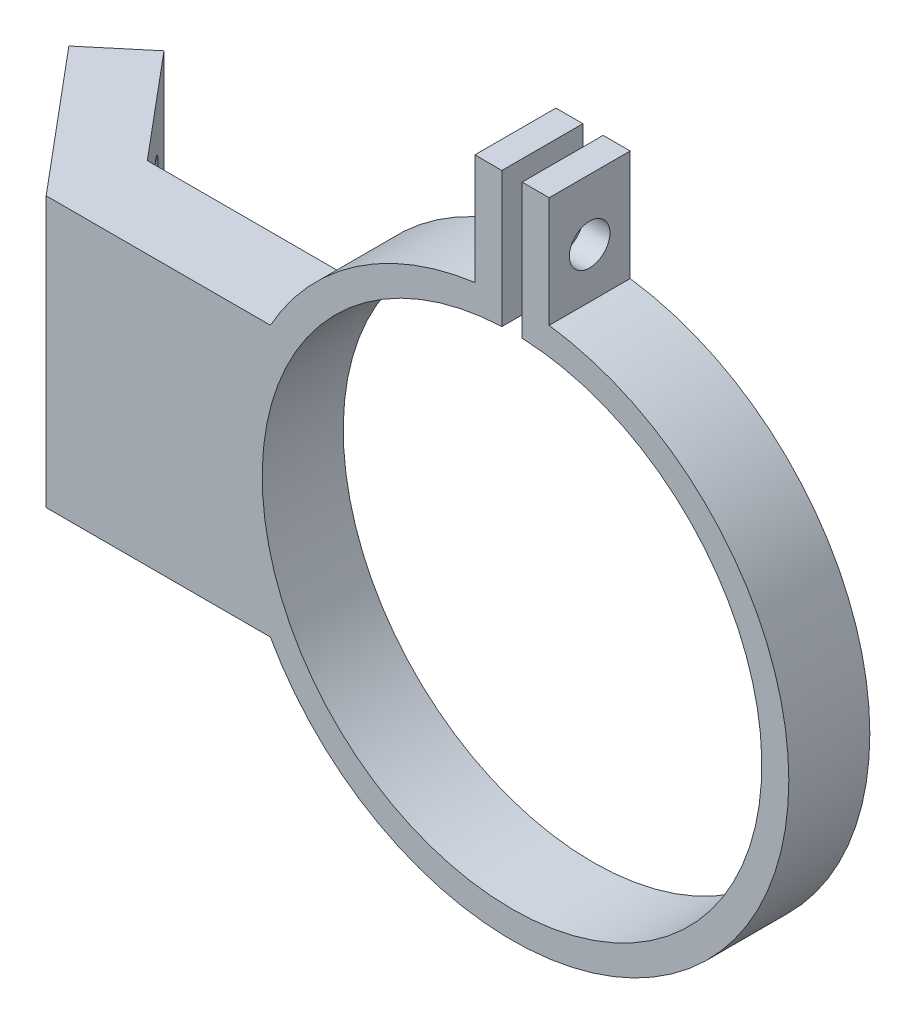
ISO-10303-21;
HEADER;
FILE_DESCRIPTION(('STEP AP214'),'2;1');
FILE_NAME('part.step','',(''),(''),'','','');
FILE_SCHEMA(('AUTOMOTIVE_DESIGN { 1 0 10303 214 1 1 1 1 }'));
ENDSEC;
DATA;
#1=APPLICATION_CONTEXT('core data for automotive mechanical design processes');
#2=APPLICATION_PROTOCOL_DEFINITION('international standard','automotive_design',2000,#1);
#3=PRODUCT_CONTEXT('',#1,'mechanical');
#4=PRODUCT('Part','Part','',(#3));
#5=PRODUCT_RELATED_PRODUCT_CATEGORY('part','',(#4));
#6=PRODUCT_DEFINITION_FORMATION('','',#4);
#7=PRODUCT_DEFINITION_CONTEXT('part definition',#1,'design');
#8=PRODUCT_DEFINITION('design','',#6,#7);
#9=PRODUCT_DEFINITION_SHAPE('','',#8);
#10=(LENGTH_UNIT() NAMED_UNIT(*) SI_UNIT(.MILLI.,.METRE.));
#11=(NAMED_UNIT(*) PLANE_ANGLE_UNIT() SI_UNIT($,.RADIAN.));
#12=(NAMED_UNIT(*) SI_UNIT($,.STERADIAN.) SOLID_ANGLE_UNIT());
#13=UNCERTAINTY_MEASURE_WITH_UNIT(LENGTH_MEASURE(1.E-05),#10,'distance_accuracy_value','');
#14=(GEOMETRIC_REPRESENTATION_CONTEXT(3) GLOBAL_UNCERTAINTY_ASSIGNED_CONTEXT((#13)) GLOBAL_UNIT_ASSIGNED_CONTEXT((#10,
#11,#12)) REPRESENTATION_CONTEXT('',''));
#15=CARTESIAN_POINT('',(0.,0.,0.));
#16=DIRECTION('',(0.,0.,1.));
#17=DIRECTION('',(1.,0.,0.));
#18=AXIS2_PLACEMENT_3D('',#15,#16,#17);
#19=CARTESIAN_POINT('',(0.,0.,-3.));
#20=DIRECTION('',(0.,0.,1.));
#21=DIRECTION('',(1.,0.,0.));
#22=AXIS2_PLACEMENT_3D('',#19,#20,#21);
#23=PLANE('',#22);
#24=DIRECTION('',(0.,-1.,0.));
#25=VECTOR('',#24,1.);
#26=CARTESIAN_POINT('',(-33.0075613404023,27.083217584686,-3.));
#27=LINE('',#26,#25);
#28=CARTESIAN_POINT('',(-33.0075613404023,10.,-3.));
#29=VERTEX_POINT('',#28);
#30=CARTESIAN_POINT('',(-33.0075613404023,-10.,-3.));
#31=VERTEX_POINT('',#30);
#32=EDGE_CURVE('E216',#29,#31,#27,.T.);
#33=ORIENTED_EDGE('',*,*,#32,.F.);
#34=DIRECTION('',(1.,0.,0.));
#35=VECTOR('',#34,1.);
#36=CARTESIAN_POINT('',(0.,10.,-3.));
#37=LINE('',#36,#35);
#38=CARTESIAN_POINT('',(-17.8955301681733,10.,-3.));
#39=VERTEX_POINT('',#38);
#40=EDGE_CURVE('E167',#29,#39,#37,.T.);
#41=ORIENTED_EDGE('',*,*,#40,.T.);
#42=CARTESIAN_POINT('',(0.,0.,-3.));
#43=DIRECTION('',(0.,0.,1.));
#44=DIRECTION('',(1.,0.,0.));
#45=AXIS2_PLACEMENT_3D('',#42,#43,#44);
#46=CIRCLE('',#45,20.5);
#47=CARTESIAN_POINT('',(-2.75,20.3147114180832,-3.));
#48=VERTEX_POINT('',#47);
#49=EDGE_CURVE('E164',#48,#39,#46,.T.);
#50=ORIENTED_EDGE('',*,*,#49,.F.);
#51=DIRECTION('',(0.,1.,0.));
#52=VECTOR('',#51,1.);
#53=CARTESIAN_POINT('',(-2.75,0.,-3.));
#54=LINE('',#53,#52);
#55=CARTESIAN_POINT('',(-2.75,28.5,-3.));
#56=VERTEX_POINT('',#55);
#57=EDGE_CURVE('E161',#48,#56,#54,.T.);
#58=ORIENTED_EDGE('',*,*,#57,.T.);
#59=DIRECTION('',(1.,0.,0.));
#60=VECTOR('',#59,1.);
#61=CARTESIAN_POINT('',(0.,28.5,-3.));
#62=LINE('',#61,#60);
#63=CARTESIAN_POINT('',(-0.749999999999997,28.5,-3.));
#64=VERTEX_POINT('',#63);
#65=EDGE_CURVE('E158',#56,#64,#62,.T.);
#66=ORIENTED_EDGE('',*,*,#65,.T.);
#67=DIRECTION('',(0.,-1.,0.));
#68=VECTOR('',#67,1.);
#69=CARTESIAN_POINT('',(-0.749999999999997,0.,-3.));
#70=LINE('',#69,#68);
#71=CARTESIAN_POINT('',(-0.749999999999997,18.4847910456137,-3.));
#72=VERTEX_POINT('',#71);
#73=EDGE_CURVE('E154',#64,#72,#70,.T.);
#74=ORIENTED_EDGE('',*,*,#73,.T.);
#75=CARTESIAN_POINT('',(0.,0.,-3.));
#76=DIRECTION('',(0.,0.,1.));
#77=DIRECTION('',(1.,0.,0.));
#78=AXIS2_PLACEMENT_3D('',#75,#76,#77);
#79=CIRCLE('',#78,18.5);
#80=CARTESIAN_POINT('',(0.750000000000004,18.4847910456137,-3.));
#81=VERTEX_POINT('',#80);
#82=EDGE_CURVE('E151',#72,#81,#79,.T.);
#83=ORIENTED_EDGE('',*,*,#82,.T.);
#84=DIRECTION('',(0.,-1.,0.));
#85=VECTOR('',#84,1.);
#86=CARTESIAN_POINT('',(0.750000000000008,0.,-3.));
#87=LINE('',#86,#85);
#88=CARTESIAN_POINT('',(0.750000000000002,28.5,-3.));
#89=VERTEX_POINT('',#88);
#90=EDGE_CURVE('E175',#89,#81,#87,.T.);
#91=ORIENTED_EDGE('',*,*,#90,.F.);
#92=DIRECTION('',(1.,0.,0.));
#93=VECTOR('',#92,1.);
#94=CARTESIAN_POINT('',(0.,28.5,-3.));
#95=LINE('',#94,#93);
#96=CARTESIAN_POINT('',(2.75,28.5,-3.));
#97=VERTEX_POINT('',#96);
#98=EDGE_CURVE('E173',#89,#97,#95,.T.);
#99=ORIENTED_EDGE('',*,*,#98,.T.);
#100=DIRECTION('',(0.,-1.,0.));
#101=VECTOR('',#100,1.);
#102=CARTESIAN_POINT('',(2.75,0.,-3.));
#103=LINE('',#102,#101);
#104=CARTESIAN_POINT('',(2.75,20.3147114180832,-3.));
#105=VERTEX_POINT('',#104);
#106=EDGE_CURVE('E132',#97,#105,#103,.T.);
#107=ORIENTED_EDGE('',*,*,#106,.T.);
#108=CARTESIAN_POINT('',(-17.8955301681733,-10.,-3.));
#109=VERTEX_POINT('',#108);
#110=EDGE_CURVE('E168',#109,#105,#46,.T.);
#111=ORIENTED_EDGE('',*,*,#110,.F.);
#112=DIRECTION('',(1.,0.,0.));
#113=VECTOR('',#112,1.);
#114=CARTESIAN_POINT('',(0.,-10.,-3.));
#115=LINE('',#114,#113);
#116=EDGE_CURVE('E170',#31,#109,#115,.T.);
#117=ORIENTED_EDGE('',*,*,#116,.F.);
#118=EDGE_LOOP('',(#33,#41,#50,#58,#66,#74,#83,#91,#99,#107,#111,#117));
#119=FACE_BOUND('',#118,.T.);
#120=ADVANCED_FACE('F35',(#119),#23,.F.);
#121=CARTESIAN_POINT('',(0.,0.,3.));
#122=DIRECTION('',(0.,0.,-1.));
#123=DIRECTION('',(-1.,0.,0.));
#124=AXIS2_PLACEMENT_3D('',#121,#122,#123);
#125=CYLINDRICAL_SURFACE('',#124,18.5);
#126=ORIENTED_EDGE('',*,*,#82,.F.);
#127=DIRECTION('',(0.,0.,-1.));
#128=VECTOR('',#127,1.);
#129=CARTESIAN_POINT('',(-0.749999999999997,18.4847910456137,3.));
#130=LINE('',#129,#128);
#131=CARTESIAN_POINT('',(-0.749999999999997,18.4847910456137,3.));
#132=VERTEX_POINT('',#131);
#133=EDGE_CURVE('E11',#132,#72,#130,.T.);
#134=ORIENTED_EDGE('',*,*,#133,.F.);
#135=CARTESIAN_POINT('',(0.,0.,3.));
#136=DIRECTION('',(0.,0.,1.));
#137=DIRECTION('',(1.,0.,0.));
#138=AXIS2_PLACEMENT_3D('',#135,#136,#137);
#139=CIRCLE('',#138,18.5);
#140=CARTESIAN_POINT('',(0.750000000000004,18.4847910456137,3.));
#141=VERTEX_POINT('',#140);
#142=EDGE_CURVE('E177',#132,#141,#139,.T.);
#143=ORIENTED_EDGE('',*,*,#142,.T.);
#144=DIRECTION('',(0.,0.,-1.));
#145=VECTOR('',#144,1.);
#146=CARTESIAN_POINT('',(0.750000000000004,18.4847910456137,3.));
#147=LINE('',#146,#145);
#148=EDGE_CURVE('E99',#141,#81,#147,.T.);
#149=ORIENTED_EDGE('',*,*,#148,.T.);
#150=EDGE_LOOP('',(#126,#134,#143,#149));
#151=FACE_BOUND('',#150,.T.);
#152=ADVANCED_FACE('F37',(#151),#125,.F.);
#153=CARTESIAN_POINT('',(-0.749999999999997,0.,3.));
#154=DIRECTION('',(1.,0.,0.));
#155=DIRECTION('',(0.,0.,-1.));
#156=AXIS2_PLACEMENT_3D('',#153,#154,#155);
#157=PLANE('',#156);
#158=CARTESIAN_POINT('',(-0.749999999999994,24.,0.));
#159=DIRECTION('',(1.,0.,0.));
#160=DIRECTION('',(0.,0.,-1.));
#161=AXIS2_PLACEMENT_3D('',#158,#159,#160);
#162=CIRCLE('',#161,1.5);
#163=CARTESIAN_POINT('',(-0.749999999999994,24.,-1.5));
#164=VERTEX_POINT('',#163);
#165=EDGE_CURVE('E155',#164,#164,#162,.T.);
#166=ORIENTED_EDGE('',*,*,#165,.F.);
#167=EDGE_LOOP('',(#166));
#168=FACE_BOUND('',#167,.T.);
#169=ORIENTED_EDGE('',*,*,#73,.F.);
#170=DIRECTION('',(0.,0.,-1.));
#171=VECTOR('',#170,1.);
#172=CARTESIAN_POINT('',(-0.749999999999997,28.5,3.));
#173=LINE('',#172,#171);
#174=CARTESIAN_POINT('',(-0.749999999999997,28.5,3.));
#175=VERTEX_POINT('',#174);
#176=EDGE_CURVE('E44',#175,#64,#173,.T.);
#177=ORIENTED_EDGE('',*,*,#176,.F.);
#178=DIRECTION('',(0.,-1.,0.));
#179=VECTOR('',#178,1.);
#180=CARTESIAN_POINT('',(-0.749999999999997,0.,3.));
#181=LINE('',#180,#179);
#182=EDGE_CURVE('E240',#175,#132,#181,.T.);
#183=ORIENTED_EDGE('',*,*,#182,.T.);
#184=ORIENTED_EDGE('',*,*,#133,.T.);
#185=EDGE_LOOP('',(#169,#177,#183,#184));
#186=FACE_BOUND('',#185,.T.);
#187=ADVANCED_FACE('F277',(#168,#186),#157,.T.);
#188=CARTESIAN_POINT('',(0.,28.5,3.));
#189=DIRECTION('',(0.,1.,0.));
#190=DIRECTION('',(0.,0.,1.));
#191=AXIS2_PLACEMENT_3D('',#188,#189,#190);
#192=PLANE('',#191);
#193=ORIENTED_EDGE('',*,*,#65,.F.);
#194=DIRECTION('',(0.,0.,-1.));
#195=VECTOR('',#194,1.);
#196=CARTESIAN_POINT('',(-2.75,28.5,3.));
#197=LINE('',#196,#195);
#198=CARTESIAN_POINT('',(-2.75,28.5,3.));
#199=VERTEX_POINT('',#198);
#200=EDGE_CURVE('E189',#199,#56,#197,.T.);
#201=ORIENTED_EDGE('',*,*,#200,.F.);
#202=DIRECTION('',(1.,0.,0.));
#203=VECTOR('',#202,1.);
#204=CARTESIAN_POINT('',(0.,28.5,3.));
#205=LINE('',#204,#203);
#206=EDGE_CURVE('E243',#199,#175,#205,.T.);
#207=ORIENTED_EDGE('',*,*,#206,.T.);
#208=ORIENTED_EDGE('',*,*,#176,.T.);
#209=EDGE_LOOP('',(#193,#201,#207,#208));
#210=FACE_BOUND('',#209,.T.);
#211=ADVANCED_FACE('F280',(#210),#192,.T.);
#212=CARTESIAN_POINT('',(-2.75,0.,3.));
#213=DIRECTION('',(-1.,0.,0.));
#214=DIRECTION('',(0.,0.,1.));
#215=AXIS2_PLACEMENT_3D('',#212,#213,#214);
#216=PLANE('',#215);
#217=CARTESIAN_POINT('',(-2.75,24.,0.));
#218=DIRECTION('',(-1.,0.,0.));
#219=DIRECTION('',(0.,0.,1.));
#220=AXIS2_PLACEMENT_3D('',#217,#218,#219);
#221=CIRCLE('',#220,1.5);
#222=CARTESIAN_POINT('',(-2.75,24.,1.5));
#223=VERTEX_POINT('',#222);
#224=EDGE_CURVE('E234',#223,#223,#221,.T.);
#225=ORIENTED_EDGE('',*,*,#224,.F.);
#226=EDGE_LOOP('',(#225));
#227=FACE_BOUND('',#226,.T.);
#228=ORIENTED_EDGE('',*,*,#57,.F.);
#229=DIRECTION('',(0.,0.,-1.));
#230=VECTOR('',#229,1.);
#231=CARTESIAN_POINT('',(-2.75,20.3147114180832,3.));
#232=LINE('',#231,#230);
#233=CARTESIAN_POINT('',(-2.75,20.3147114180832,3.));
#234=VERTEX_POINT('',#233);
#235=EDGE_CURVE('E187',#234,#48,#232,.T.);
#236=ORIENTED_EDGE('',*,*,#235,.F.);
#237=DIRECTION('',(0.,1.,0.));
#238=VECTOR('',#237,1.);
#239=CARTESIAN_POINT('',(-2.75,0.,3.));
#240=LINE('',#239,#238);
#241=EDGE_CURVE('E246',#234,#199,#240,.T.);
#242=ORIENTED_EDGE('',*,*,#241,.T.);
#243=ORIENTED_EDGE('',*,*,#200,.T.);
#244=EDGE_LOOP('',(#228,#236,#242,#243));
#245=FACE_BOUND('',#244,.T.);
#246=ADVANCED_FACE('F284',(#227,#245),#216,.T.);
#247=CARTESIAN_POINT('',(0.,0.,3.));
#248=DIRECTION('',(0.,0.,-1.));
#249=DIRECTION('',(-1.,0.,0.));
#250=AXIS2_PLACEMENT_3D('',#247,#248,#249);
#251=CYLINDRICAL_SURFACE('',#250,20.5);
#252=ORIENTED_EDGE('',*,*,#49,.T.);
#253=DIRECTION('',(0.,0.,-1.));
#254=VECTOR('',#253,1.);
#255=CARTESIAN_POINT('',(-17.8955301681733,10.,3.));
#256=LINE('',#255,#254);
#257=CARTESIAN_POINT('',(-17.8955301681733,10.,3.));
#258=VERTEX_POINT('',#257);
#259=EDGE_CURVE('E184',#258,#39,#256,.T.);
#260=ORIENTED_EDGE('',*,*,#259,.F.);
#261=CARTESIAN_POINT('',(0.,0.,3.));
#262=DIRECTION('',(0.,0.,1.));
#263=DIRECTION('',(1.,0.,0.));
#264=AXIS2_PLACEMENT_3D('',#261,#262,#263);
#265=CIRCLE('',#264,20.5);
#266=EDGE_CURVE('E249',#234,#258,#265,.T.);
#267=ORIENTED_EDGE('',*,*,#266,.F.);
#268=ORIENTED_EDGE('',*,*,#235,.T.);
#269=EDGE_LOOP('',(#252,#260,#267,#268));
#270=FACE_BOUND('',#269,.T.);
#271=ADVANCED_FACE('F289',(#270),#251,.T.);
#272=CARTESIAN_POINT('',(0.,10.,3.));
#273=DIRECTION('',(0.,1.,0.));
#274=DIRECTION('',(0.,0.,1.));
#275=AXIS2_PLACEMENT_3D('',#272,#273,#274);
#276=PLANE('',#275);
#277=DIRECTION('',(0.642787609686543,0.,0.766044443118975));
#278=VECTOR('',#277,1.);
#279=CARTESIAN_POINT('',(-34.5,10.,3.));
#280=LINE('',#279,#278);
#281=CARTESIAN_POINT('',(-43.2656596528626,10.,-7.44650638275703));
#282=VERTEX_POINT('',#281);
#283=CARTESIAN_POINT('',(-34.5,10.,3.));
#284=VERTEX_POINT('',#283);
#285=EDGE_CURVE('E222',#282,#284,#280,.T.);
#286=ORIENTED_EDGE('',*,*,#285,.T.);
#287=DIRECTION('',(1.,0.,0.));
#288=VECTOR('',#287,1.);
#289=CARTESIAN_POINT('',(0.,10.,3.));
#290=LINE('',#289,#288);
#291=EDGE_CURVE('E251',#284,#258,#290,.T.);
#292=ORIENTED_EDGE('',*,*,#291,.T.);
#293=ORIENTED_EDGE('',*,*,#259,.T.);
#294=ORIENTED_EDGE('',*,*,#40,.F.);
#295=DIRECTION('',(-0.642787609686543,0.,-0.766044443118975));
#296=VECTOR('',#295,1.);
#297=CARTESIAN_POINT('',(-39.4354374372677,10.,-10.6604444311897));
#298=LINE('',#297,#296);
#299=CARTESIAN_POINT('',(-39.4354374372677,10.,-10.6604444311897));
#300=VERTEX_POINT('',#299);
#301=EDGE_CURVE('E219',#29,#300,#298,.T.);
#302=ORIENTED_EDGE('',*,*,#301,.T.);
#303=DIRECTION('',(-0.766044443118975,0.,0.642787609686543));
#304=VECTOR('',#303,1.);
#305=CARTESIAN_POINT('',(-43.2656596528626,10.,-7.44650638275703));
#306=LINE('',#305,#304);
#307=EDGE_CURVE('E195',#300,#282,#306,.T.);
#308=ORIENTED_EDGE('',*,*,#307,.T.);
#309=EDGE_LOOP('',(#286,#292,#293,#294,#302,#308));
#310=FACE_BOUND('',#309,.T.);
#311=ADVANCED_FACE('F292',(#310),#276,.T.);
#312=CARTESIAN_POINT('',(0.,-10.,3.));
#313=DIRECTION('',(0.,1.,0.));
#314=DIRECTION('',(0.,0.,1.));
#315=AXIS2_PLACEMENT_3D('',#312,#313,#314);
#316=PLANE('',#315);
#317=DIRECTION('',(1.,0.,0.));
#318=VECTOR('',#317,1.);
#319=CARTESIAN_POINT('',(0.,-10.,3.));
#320=LINE('',#319,#318);
#321=CARTESIAN_POINT('',(-34.5,-10.,3.));
#322=VERTEX_POINT('',#321);
#323=CARTESIAN_POINT('',(-17.8955301681733,-10.,3.));
#324=VERTEX_POINT('',#323);
#325=EDGE_CURVE('E256',#322,#324,#320,.T.);
#326=ORIENTED_EDGE('',*,*,#325,.F.);
#327=DIRECTION('',(-0.642787609686543,0.,-0.766044443118975));
#328=VECTOR('',#327,1.);
#329=CARTESIAN_POINT('',(-34.5,-10.,3.));
#330=LINE('',#329,#328);
#331=CARTESIAN_POINT('',(-43.2656596528626,-10.,-7.44650638275703));
#332=VERTEX_POINT('',#331);
#333=EDGE_CURVE('E212',#322,#332,#330,.T.);
#334=ORIENTED_EDGE('',*,*,#333,.T.);
#335=DIRECTION('',(0.766044443118975,0.,-0.642787609686543));
#336=VECTOR('',#335,1.);
#337=CARTESIAN_POINT('',(-43.2656596528626,-10.,-7.44650638275703));
#338=LINE('',#337,#336);
#339=CARTESIAN_POINT('',(-39.4354374372677,-10.,-10.6604444311897));
#340=VERTEX_POINT('',#339);
#341=EDGE_CURVE('E210',#332,#340,#338,.T.);
#342=ORIENTED_EDGE('',*,*,#341,.T.);
#343=DIRECTION('',(0.642787609686543,0.,0.766044443118975));
#344=VECTOR('',#343,1.);
#345=CARTESIAN_POINT('',(-39.4354374372677,-10.,-10.6604444311897));
#346=LINE('',#345,#344);
#347=EDGE_CURVE('E52',#340,#31,#346,.T.);
#348=ORIENTED_EDGE('',*,*,#347,.T.);
#349=ORIENTED_EDGE('',*,*,#116,.T.);
#350=DIRECTION('',(0.,0.,-1.));
#351=VECTOR('',#350,1.);
#352=CARTESIAN_POINT('',(-17.8955301681733,-10.,3.));
#353=LINE('',#352,#351);
#354=EDGE_CURVE('E181',#324,#109,#353,.T.);
#355=ORIENTED_EDGE('',*,*,#354,.F.);
#356=EDGE_LOOP('',(#326,#334,#342,#348,#349,#355));
#357=FACE_BOUND('',#356,.T.);
#358=ADVANCED_FACE('F262',(#357),#316,.F.);
#359=ORIENTED_EDGE('',*,*,#110,.T.);
#360=DIRECTION('',(0.,0.,-1.));
#361=VECTOR('',#360,1.);
#362=CARTESIAN_POINT('',(2.75,20.3147114180832,3.));
#363=LINE('',#362,#361);
#364=CARTESIAN_POINT('',(2.75,20.3147114180832,3.));
#365=VERTEX_POINT('',#364);
#366=EDGE_CURVE('E137',#365,#105,#363,.T.);
#367=ORIENTED_EDGE('',*,*,#366,.F.);
#368=EDGE_CURVE('E143',#324,#365,#265,.T.);
#369=ORIENTED_EDGE('',*,*,#368,.F.);
#370=ORIENTED_EDGE('',*,*,#354,.T.);
#371=EDGE_LOOP('',(#359,#367,#369,#370));
#372=FACE_BOUND('',#371,.T.);
#373=ADVANCED_FACE('F267',(#372),#251,.T.);
#374=CARTESIAN_POINT('',(2.75,0.,3.));
#375=DIRECTION('',(1.,0.,0.));
#376=DIRECTION('',(0.,0.,-1.));
#377=AXIS2_PLACEMENT_3D('',#374,#375,#376);
#378=PLANE('',#377);
#379=CARTESIAN_POINT('',(2.75,24.,0.));
#380=DIRECTION('',(1.,0.,0.));
#381=DIRECTION('',(0.,0.,-1.));
#382=AXIS2_PLACEMENT_3D('',#379,#380,#381);
#383=CIRCLE('',#382,1.5);
#384=CARTESIAN_POINT('',(2.75,24.,-1.5));
#385=VERTEX_POINT('',#384);
#386=EDGE_CURVE('E194',#385,#385,#383,.T.);
#387=ORIENTED_EDGE('',*,*,#386,.F.);
#388=EDGE_LOOP('',(#387));
#389=FACE_BOUND('',#388,.T.);
#390=ORIENTED_EDGE('',*,*,#106,.F.);
#391=DIRECTION('',(0.,0.,-1.));
#392=VECTOR('',#391,1.);
#393=CARTESIAN_POINT('',(2.75,28.5,3.));
#394=LINE('',#393,#392);
#395=CARTESIAN_POINT('',(2.75,28.5,3.));
#396=VERTEX_POINT('',#395);
#397=EDGE_CURVE('E127',#396,#97,#394,.T.);
#398=ORIENTED_EDGE('',*,*,#397,.F.);
#399=DIRECTION('',(0.,-1.,0.));
#400=VECTOR('',#399,1.);
#401=CARTESIAN_POINT('',(2.75,0.,3.));
#402=LINE('',#401,#400);
#403=EDGE_CURVE('E130',#396,#365,#402,.T.);
#404=ORIENTED_EDGE('',*,*,#403,.T.);
#405=ORIENTED_EDGE('',*,*,#366,.T.);
#406=EDGE_LOOP('',(#390,#398,#404,#405));
#407=FACE_BOUND('',#406,.T.);
#408=ADVANCED_FACE('F129',(#389,#407),#378,.T.);
#409=CARTESIAN_POINT('',(0.,28.5,3.));
#410=DIRECTION('',(0.,1.,0.));
#411=DIRECTION('',(0.,0.,1.));
#412=AXIS2_PLACEMENT_3D('',#409,#410,#411);
#413=PLANE('',#412);
#414=ORIENTED_EDGE('',*,*,#98,.F.);
#415=DIRECTION('',(0.,0.,-1.));
#416=VECTOR('',#415,1.);
#417=CARTESIAN_POINT('',(0.750000000000002,28.5,3.));
#418=LINE('',#417,#416);
#419=CARTESIAN_POINT('',(0.750000000000002,28.5,3.));
#420=VERTEX_POINT('',#419);
#421=EDGE_CURVE('E138',#420,#89,#418,.T.);
#422=ORIENTED_EDGE('',*,*,#421,.F.);
#423=DIRECTION('',(1.,0.,0.));
#424=VECTOR('',#423,1.);
#425=CARTESIAN_POINT('',(0.,28.5,3.));
#426=LINE('',#425,#424);
#427=EDGE_CURVE('E141',#420,#396,#426,.T.);
#428=ORIENTED_EDGE('',*,*,#427,.T.);
#429=ORIENTED_EDGE('',*,*,#397,.T.);
#430=EDGE_LOOP('',(#414,#422,#428,#429));
#431=FACE_BOUND('',#430,.T.);
#432=ADVANCED_FACE('F146',(#431),#413,.T.);
#433=CARTESIAN_POINT('',(0.750000000000008,0.,3.));
#434=DIRECTION('',(1.,0.,0.));
#435=DIRECTION('',(0.,1.,0.));
#436=AXIS2_PLACEMENT_3D('',#433,#434,#435);
#437=PLANE('',#436);
#438=CARTESIAN_POINT('',(0.750000000000001,24.,0.));
#439=DIRECTION('',(1.,0.,0.));
#440=DIRECTION('',(0.,1.,0.));
#441=AXIS2_PLACEMENT_3D('',#438,#439,#440);
#442=CIRCLE('',#441,1.5);
#443=CARTESIAN_POINT('',(0.75,25.5,0.));
#444=VERTEX_POINT('',#443);
#445=EDGE_CURVE('E192',#444,#444,#442,.T.);
#446=ORIENTED_EDGE('',*,*,#445,.T.);
#447=EDGE_LOOP('',(#446));
#448=FACE_BOUND('',#447,.T.);
#449=ORIENTED_EDGE('',*,*,#90,.T.);
#450=ORIENTED_EDGE('',*,*,#148,.F.);
#451=DIRECTION('',(0.,-1.,0.));
#452=VECTOR('',#451,1.);
#453=CARTESIAN_POINT('',(0.750000000000008,0.,3.));
#454=LINE('',#453,#452);
#455=EDGE_CURVE('E61',#420,#141,#454,.T.);
#456=ORIENTED_EDGE('',*,*,#455,.F.);
#457=ORIENTED_EDGE('',*,*,#421,.T.);
#458=EDGE_LOOP('',(#449,#450,#456,#457));
#459=FACE_BOUND('',#458,.T.);
#460=ADVANCED_FACE('F272',(#448,#459),#437,.F.);
#461=CARTESIAN_POINT('',(0.,0.,3.));
#462=DIRECTION('',(0.,0.,1.));
#463=DIRECTION('',(1.,0.,0.));
#464=AXIS2_PLACEMENT_3D('',#461,#462,#463);
#465=PLANE('',#464);
#466=ORIENTED_EDGE('',*,*,#142,.F.);
#467=ORIENTED_EDGE('',*,*,#182,.F.);
#468=ORIENTED_EDGE('',*,*,#206,.F.);
#469=ORIENTED_EDGE('',*,*,#241,.F.);
#470=ORIENTED_EDGE('',*,*,#266,.T.);
#471=ORIENTED_EDGE('',*,*,#291,.F.);
#472=DIRECTION('',(0.,1.,0.));
#473=VECTOR('',#472,1.);
#474=CARTESIAN_POINT('',(-34.5,0.,3.));
#475=LINE('',#474,#473);
#476=EDGE_CURVE('E254',#322,#284,#475,.T.);
#477=ORIENTED_EDGE('',*,*,#476,.F.);
#478=ORIENTED_EDGE('',*,*,#325,.T.);
#479=ORIENTED_EDGE('',*,*,#368,.T.);
#480=ORIENTED_EDGE('',*,*,#403,.F.);
#481=ORIENTED_EDGE('',*,*,#427,.F.);
#482=ORIENTED_EDGE('',*,*,#455,.T.);
#483=EDGE_LOOP('',(#466,#467,#468,#469,#470,#471,#477,#478,#479,#480,#481,#482));
#484=FACE_BOUND('',#483,.T.);
#485=ADVANCED_FACE('F140',(#484),#465,.T.);
#486=CARTESIAN_POINT('',(-34.5,24.,0.));
#487=DIRECTION('',(1.,0.,0.));
#488=DIRECTION('',(0.,0.,-1.));
#489=AXIS2_PLACEMENT_3D('',#486,#487,#488);
#490=CYLINDRICAL_SURFACE('',#489,1.5);
#491=ORIENTED_EDGE('',*,*,#386,.T.);
#492=EDGE_LOOP('',(#491));
#493=FACE_BOUND('',#492,.T.);
#494=ORIENTED_EDGE('',*,*,#445,.F.);
#495=EDGE_LOOP('',(#494));
#496=FACE_BOUND('',#495,.T.);
#497=ADVANCED_FACE('F325',(#493,#496),#490,.F.);
#498=ORIENTED_EDGE('',*,*,#165,.T.);
#499=EDGE_LOOP('',(#498));
#500=FACE_BOUND('',#499,.T.);
#501=ORIENTED_EDGE('',*,*,#224,.T.);
#502=EDGE_LOOP('',(#501));
#503=FACE_BOUND('',#502,.T.);
#504=ADVANCED_FACE('F317',(#500,#503),#490,.F.);
#505=CARTESIAN_POINT('',(-39.4354374372677,27.083217584686,-10.6604444311897));
#506=DIRECTION('',(-0.766044443118975,0.,0.642787609686543));
#507=DIRECTION('',(0.642787609686543,0.,0.766044443118975));
#508=AXIS2_PLACEMENT_3D('',#505,#506,#507);
#509=PLANE('',#508);
#510=CARTESIAN_POINT('',(-36.2214993888428,4.99999999999213,-6.83022221560415));
#511=DIRECTION('',(-0.766044443118975,0.,0.642787609686543));
#512=DIRECTION('',(0.642787609686543,0.,0.766044443118975));
#513=AXIS2_PLACEMENT_3D('',#510,#511,#512);
#514=CIRCLE('',#513,1.5);
#515=CARTESIAN_POINT('',(-35.257317974313,4.99999999999213,-5.68115555092569));
#516=VERTEX_POINT('',#515);
#517=EDGE_CURVE('E206',#516,#516,#514,.T.);
#518=ORIENTED_EDGE('',*,*,#517,.T.);
#519=EDGE_LOOP('',(#518));
#520=FACE_BOUND('',#519,.T.);
#521=CARTESIAN_POINT('',(-36.2214993888428,-5.00000000000787,-6.83022221560415));
#522=DIRECTION('',(-0.766044443118975,0.,0.642787609686543));
#523=DIRECTION('',(0.642787609686543,0.,0.766044443118975));
#524=AXIS2_PLACEMENT_3D('',#521,#522,#523);
#525=CIRCLE('',#524,1.5);
#526=CARTESIAN_POINT('',(-35.257317974313,-5.00000000000787,-5.68115555092569));
#527=VERTEX_POINT('',#526);
#528=EDGE_CURVE('E198',#527,#527,#525,.T.);
#529=ORIENTED_EDGE('',*,*,#528,.T.);
#530=EDGE_LOOP('',(#529));
#531=FACE_BOUND('',#530,.T.);
#532=ORIENTED_EDGE('',*,*,#301,.F.);
#533=ORIENTED_EDGE('',*,*,#32,.T.);
#534=ORIENTED_EDGE('',*,*,#347,.F.);
#535=DIRECTION('',(0.,-1.,0.));
#536=VECTOR('',#535,1.);
#537=CARTESIAN_POINT('',(-39.4354374372677,27.083217584686,-10.6604444311897));
#538=LINE('',#537,#536);
#539=EDGE_CURVE('E227',#300,#340,#538,.T.);
#540=ORIENTED_EDGE('',*,*,#539,.F.);
#541=EDGE_LOOP('',(#532,#533,#534,#540));
#542=FACE_BOUND('',#541,.T.);
#543=ADVANCED_FACE('F315',(#520,#531,#542),#509,.F.);
#544=CARTESIAN_POINT('',(-43.2656596528626,27.083217584686,-7.44650638275703));
#545=DIRECTION('',(0.642787609686543,0.,0.766044443118975));
#546=DIRECTION('',(0.766044443118975,0.,-0.642787609686543));
#547=AXIS2_PLACEMENT_3D('',#544,#545,#546);
#548=PLANE('',#547);
#549=ORIENTED_EDGE('',*,*,#307,.F.);
#550=ORIENTED_EDGE('',*,*,#539,.T.);
#551=ORIENTED_EDGE('',*,*,#341,.F.);
#552=DIRECTION('',(0.,-1.,0.));
#553=VECTOR('',#552,1.);
#554=CARTESIAN_POINT('',(-43.2656596528626,27.083217584686,-7.44650638275703));
#555=LINE('',#554,#553);
#556=EDGE_CURVE('E225',#282,#332,#555,.T.);
#557=ORIENTED_EDGE('',*,*,#556,.F.);
#558=EDGE_LOOP('',(#549,#550,#551,#557));
#559=FACE_BOUND('',#558,.T.);
#560=ADVANCED_FACE('F314',(#559),#548,.F.);
#561=CARTESIAN_POINT('',(-34.5,27.083217584686,3.));
#562=DIRECTION('',(0.766044443118975,0.,-0.642787609686543));
#563=DIRECTION('',(-0.642787609686543,0.,-0.766044443118975));
#564=AXIS2_PLACEMENT_3D('',#561,#562,#563);
#565=PLANE('',#564);
#566=CARTESIAN_POINT('',(-40.0517216044377,4.99999999999213,-3.61628416717143));
#567=DIRECTION('',(0.766044443118975,0.,-0.642787609686543));
#568=DIRECTION('',(-0.642787609686543,0.,-0.766044443118975));
#569=AXIS2_PLACEMENT_3D('',#566,#567,#568);
#570=CIRCLE('',#569,1.5);
#571=CARTESIAN_POINT('',(-41.0159030189675,4.99999999999213,-4.7653508318499));
#572=VERTEX_POINT('',#571);
#573=EDGE_CURVE('E39',#572,#572,#570,.T.);
#574=ORIENTED_EDGE('',*,*,#573,.T.);
#575=EDGE_LOOP('',(#574));
#576=FACE_BOUND('',#575,.T.);
#577=CARTESIAN_POINT('',(-40.0517216044377,-5.00000000000787,-3.61628416717143));
#578=DIRECTION('',(0.766044443118975,0.,-0.642787609686543));
#579=DIRECTION('',(-0.642787609686543,0.,-0.766044443118975));
#580=AXIS2_PLACEMENT_3D('',#577,#578,#579);
#581=CIRCLE('',#580,1.5);
#582=CARTESIAN_POINT('',(-41.0159030189675,-5.00000000000787,-4.7653508318499));
#583=VERTEX_POINT('',#582);
#584=EDGE_CURVE('E196',#583,#583,#581,.T.);
#585=ORIENTED_EDGE('',*,*,#584,.T.);
#586=EDGE_LOOP('',(#585));
#587=FACE_BOUND('',#586,.T.);
#588=ORIENTED_EDGE('',*,*,#285,.F.);
#589=ORIENTED_EDGE('',*,*,#556,.T.);
#590=ORIENTED_EDGE('',*,*,#333,.F.);
#591=ORIENTED_EDGE('',*,*,#476,.T.);
#592=EDGE_LOOP('',(#588,#589,#590,#591));
#593=FACE_BOUND('',#592,.T.);
#594=ADVANCED_FACE('F297',(#576,#587,#593),#565,.F.);
#595=CARTESIAN_POINT('',(-45.195621843253,-5.00000000000787,0.699960626031283));
#596=DIRECTION('',(0.766044443118975,0.,-0.642787609686543));
#597=DIRECTION('',(-0.642787609686543,0.,-0.766044443118975));
#598=AXIS2_PLACEMENT_3D('',#595,#596,#597);
#599=CYLINDRICAL_SURFACE('',#598,1.5);
#600=ORIENTED_EDGE('',*,*,#584,.F.);
#601=EDGE_LOOP('',(#600));
#602=FACE_BOUND('',#601,.T.);
#603=ORIENTED_EDGE('',*,*,#528,.F.);
#604=EDGE_LOOP('',(#603));
#605=FACE_BOUND('',#604,.T.);
#606=ADVANCED_FACE('F454',(#602,#605),#599,.F.);
#607=CARTESIAN_POINT('',(-45.195621843253,4.99999999999213,0.699960626031283));
#608=DIRECTION('',(0.766044443118975,0.,-0.642787609686543));
#609=DIRECTION('',(-0.642787609686543,0.,-0.766044443118975));
#610=AXIS2_PLACEMENT_3D('',#607,#608,#609);
#611=CYLINDRICAL_SURFACE('',#610,1.5);
#612=ORIENTED_EDGE('',*,*,#573,.F.);
#613=EDGE_LOOP('',(#612));
#614=FACE_BOUND('',#613,.T.);
#615=ORIENTED_EDGE('',*,*,#517,.F.);
#616=EDGE_LOOP('',(#615));
#617=FACE_BOUND('',#616,.T.);
#618=ADVANCED_FACE('F463',(#614,#617),#611,.F.);
#619=CLOSED_SHELL('',(#120,#152,#187,#211,#246,#271,#311,#358,#373,#408,#432,#460,#485,#497,
#504,#543,#560,#594,#606,#618));
#620=MANIFOLD_SOLID_BREP('B2',#619);
#621=ADVANCED_BREP_SHAPE_REPRESENTATION('',(#18,#620),#14);
#622=SHAPE_DEFINITION_REPRESENTATION(#9,#621);
ENDSEC;
END-ISO-10303-21;
